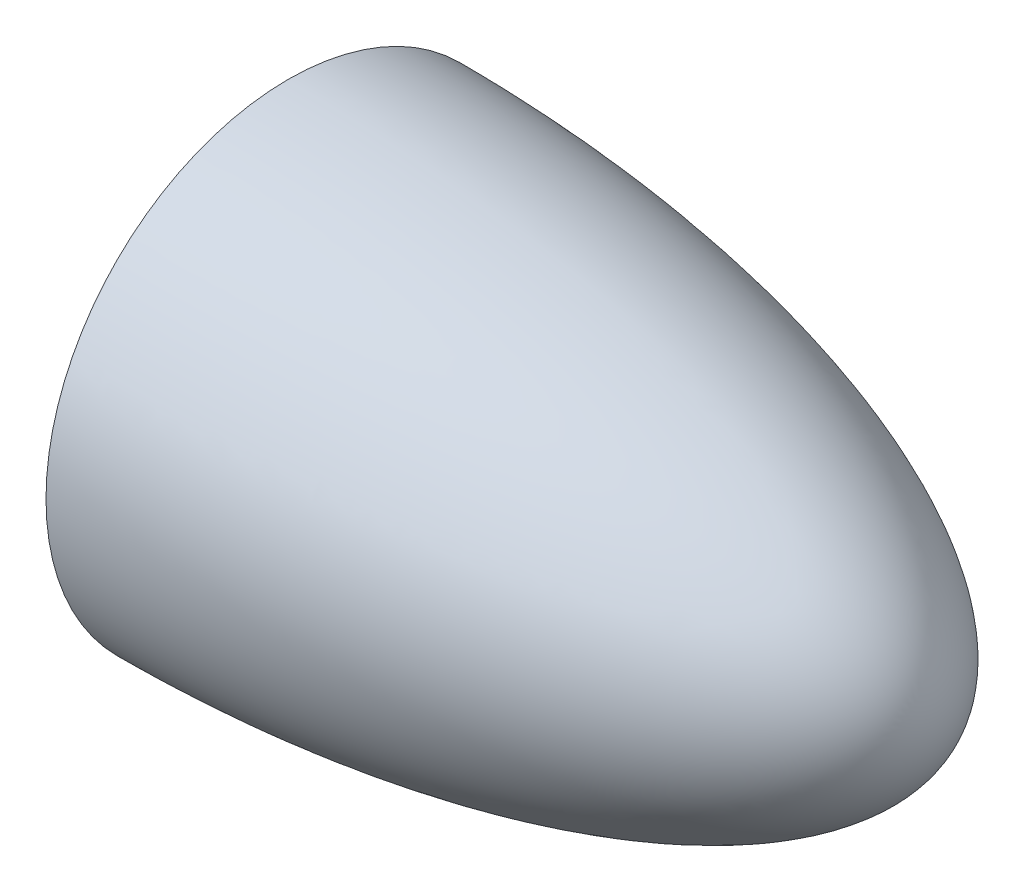
ISO-10303-21;
HEADER;
FILE_DESCRIPTION(('STEP AP214'),'2;1');
FILE_NAME('part.step','',(''),(''),'','','');
FILE_SCHEMA(('AUTOMOTIVE_DESIGN { 1 0 10303 214 1 1 1 1 }'));
ENDSEC;
DATA;
#1=APPLICATION_CONTEXT('core data for automotive mechanical design processes');
#2=APPLICATION_PROTOCOL_DEFINITION('international standard','automotive_design',2000,#1);
#3=PRODUCT_CONTEXT('',#1,'mechanical');
#4=PRODUCT('Part','Part','',(#3));
#5=PRODUCT_RELATED_PRODUCT_CATEGORY('part','',(#4));
#6=PRODUCT_DEFINITION_FORMATION('','',#4);
#7=PRODUCT_DEFINITION_CONTEXT('part definition',#1,'design');
#8=PRODUCT_DEFINITION('design','',#6,#7);
#9=PRODUCT_DEFINITION_SHAPE('','',#8);
#10=(LENGTH_UNIT() NAMED_UNIT(*) SI_UNIT(.MILLI.,.METRE.));
#11=(NAMED_UNIT(*) PLANE_ANGLE_UNIT() SI_UNIT($,.RADIAN.));
#12=(NAMED_UNIT(*) SI_UNIT($,.STERADIAN.) SOLID_ANGLE_UNIT());
#13=UNCERTAINTY_MEASURE_WITH_UNIT(LENGTH_MEASURE(1.E-05),#10,'distance_accuracy_value','');
#14=(GEOMETRIC_REPRESENTATION_CONTEXT(3) GLOBAL_UNCERTAINTY_ASSIGNED_CONTEXT((#13)) GLOBAL_UNIT_ASSIGNED_CONTEXT((#10,
#11,#12)) REPRESENTATION_CONTEXT('',''));
#15=CARTESIAN_POINT('',(0.,0.,0.));
#16=DIRECTION('',(0.,0.,1.));
#17=DIRECTION('',(1.,0.,0.));
#18=AXIS2_PLACEMENT_3D('',#15,#16,#17);
#19=CARTESIAN_POINT('',(101.600000000442,-1.42830048805565E-08,0.));
#20=CARTESIAN_POINT('',(101.599980360441,0.48323363335792,0.));
#21=CARTESIAN_POINT('',(101.55916409825,1.3889629163217,0.));
#22=CARTESIAN_POINT('',(101.380823498964,2.75715727471822,0.));
#23=CARTESIAN_POINT('',(100.938171709959,4.4725890120283,0.));
#24=CARTESIAN_POINT('',(100.331861268112,6.08897016765241,0.));
#25=CARTESIAN_POINT('',(99.5419733555983,7.69768669382983,0.));
#26=CARTESIAN_POINT('',(98.5662325669244,9.30621441511542,0.));
#27=CARTESIAN_POINT('',(97.298665836656,11.0336457708486,0.));
#28=CARTESIAN_POINT('',(95.7114523027373,12.8458752971799,0.));
#29=CARTESIAN_POINT('',(93.6297465486219,14.8636332281495,0.));
#30=CARTESIAN_POINT('',(91.0618684761844,16.9696414971854,0.));
#31=CARTESIAN_POINT('',(88.0736143415887,19.060703593436,0.));
#32=CARTESIAN_POINT('',(84.0819471067569,21.4677009974105,0.));
#33=CARTESIAN_POINT('',(79.9301974467493,23.5889965164497,0.));
#34=CARTESIAN_POINT('',(75.6687540651103,25.4756929979767,0.));
#35=CARTESIAN_POINT('',(70.4117097396729,27.5164690402247,0.));
#36=CARTESIAN_POINT('',(64.8413994370588,29.4022069077791,0.));
#37=CARTESIAN_POINT('',(59.1888689396233,31.026335536375,0.));
#38=CARTESIAN_POINT('',(53.478286526438,32.4263767824586,0.));
#39=CARTESIAN_POINT('',(48.6886027235161,33.4569390606596,0.));
#40=CARTESIAN_POINT('',(44.8412539235105,34.2042547409607,0.));
#41=CARTESIAN_POINT('',(40.98011959807,34.8782552337996,0.));
#42=CARTESIAN_POINT('',(37.1079386918977,35.4822148701438,0.));
#43=CARTESIAN_POINT('',(33.2250156494168,36.0189001691222,0.));
#44=CARTESIAN_POINT('',(29.3351731505379,36.4906677440588,0.));
#45=CARTESIAN_POINT('',(25.9229304373123,36.8483950158868,0.));
#46=CARTESIAN_POINT('',(22.998301967729,37.1167215937499,0.));
#47=CARTESIAN_POINT('',(20.5528829742709,37.3152225797583,0.));
#48=CARTESIAN_POINT('',(18.6058546115348,37.4591155736619,0.));
#49=CARTESIAN_POINT('',(16.1476970212435,37.6205191442379,0.));
#50=CARTESIAN_POINT('',(13.2403157224608,37.7849089049178,0.));
#51=CARTESIAN_POINT('',(10.2567025746124,37.9130835339428,0.));
#52=CARTESIAN_POINT('',(7.38531748689561,38.0054381493554,0.));
#53=CARTESIAN_POINT('',(4.83956379284109,38.0586501026854,0.));
#54=CARTESIAN_POINT('',(3.06234519295003,38.0870083587775,0.));
#55=CARTESIAN_POINT('',(1.33227298553929,38.0976378885102,0.));
#56=CARTESIAN_POINT('',(0.450260092714062,38.1000000009106,0.));
#57=CARTESIAN_POINT('',(6.16471890896308E-09,38.1000000009782,0.));
#58=B_SPLINE_CURVE_WITH_KNOTS('',4,(#19,#20,#21,#22,#23,#24,#25,#26,#27,#28,#29,#30,#31,#32,#33,
#34,#35,#36,#37,#38,#39,#40,#41,#42,#43,#44,#45,#46,#47,#48,#49,#50,#51,#52,#53,#54,#55,#56,
#57),.UNSPECIFIED.,.F.,.F.,(5,1,1,1,1,1,1,1,1,1,1,1,1,1,1,1,1,1,1,1,1,1,1,1,1,1,1,1,1,1,1,1,1,1,
1,5),(0.0808932835881966,0.096271967143896,0.10974671690448,0.124699008251176,0.137183447609697,
0.151141113359815,0.166736945280467,0.184522373855007,0.205319929879586,0.227752647732649,
0.258948982853048,0.290145341761614,0.321341650099034,0.376072862975788,0.407269225627566,
0.438465588279344,0.500858289877739,0.563250991378801,0.594447349480276,0.625643707581752,
0.656840067447748,0.688036427313743,0.7192327842067,0.750429141099656,0.781625497022952,
0.812821852946247,0.828420032283755,0.844018211621263,0.859616390958771,0.875214570296279,
0.906410927542586,0.937607284788894,0.953205463576025,0.968803642363157,0.984401821150288,1.),.UNSPECIFIED.);
#59=CARTESIAN_POINT('',(95.2499999953482,-1.20471063680405E-08,0.));
#60=DIRECTION('',(-1.,0.,0.));
#61=AXIS1_PLACEMENT('',#59,#60);
#62=SURFACE_OF_REVOLUTION('',#58,#61);
#63=CARTESIAN_POINT('',(-6.36116159746791E-10,-1.20470788979655E-08,0.));
#64=DIRECTION('',(-1.,0.,0.));
#65=DIRECTION('',(0.,-1.,0.));
#66=AXIS2_PLACEMENT_3D('',#63,#64,#65);
#67=CIRCLE('',#66,38.1000000130253);
#68=CARTESIAN_POINT('',(-6.36127147776795E-10,-38.1000000250723,0.));
#69=VERTEX_POINT('',#68);
#70=EDGE_CURVE('E11',#69,#69,#67,.T.);
#71=ORIENTED_EDGE('',*,*,#70,.F.);
#72=EDGE_LOOP('',(#71));
#73=FACE_BOUND('',#72,.T.);
#74=CARTESIAN_POINT('',(101.599999994479,-1.20471081993789E-08,0.));
#75=VERTEX_POINT('',#74);
#76=VERTEX_LOOP('',#75);
#77=FACE_BOUND('',#76,.T.);
#78=ADVANCED_FACE('F36',(#73,#77),#62,.T.);
#79=CARTESIAN_POINT('',(-6.36095702362055E-10,38.1000000009782,0.));
#80=DIRECTION('',(1.,0.,0.));
#81=DIRECTION('',(0.,1.,0.));
#82=AXIS2_PLACEMENT_3D('',#79,#80,#81);
#83=PLANE('',#82);
#84=CARTESIAN_POINT('',(-6.36116159746791E-10,-1.20470788979655E-08,0.));
#85=DIRECTION('',(-1.,0.,0.));
#86=DIRECTION('',(0.,-1.,0.));
#87=AXIS2_PLACEMENT_3D('',#84,#85,#86);
#88=CIRCLE('',#87,31.7500000120471);
#89=CARTESIAN_POINT('',(-6.36125316438461E-10,-31.7500000240942,0.));
#90=VERTEX_POINT('',#89);
#91=EDGE_CURVE('E44',#90,#90,#88,.T.);
#92=ORIENTED_EDGE('',*,*,#91,.F.);
#93=EDGE_LOOP('',(#92));
#94=FACE_BOUND('',#93,.T.);
#95=ORIENTED_EDGE('',*,*,#70,.T.);
#96=EDGE_LOOP('',(#95));
#97=FACE_BOUND('',#96,.T.);
#98=ADVANCED_FACE('F53',(#94,#97),#83,.F.);
#99=CARTESIAN_POINT('',(6.36089949159271E-10,31.75,0.));
#100=CARTESIAN_POINT('',(0.415190954921155,31.7499999999458,0.));
#101=CARTESIAN_POINT('',(1.25667944898068,31.7480893776024,0.));
#102=CARTESIAN_POINT('',(2.55470617475244,31.7409245248943,0.));
#103=CARTESIAN_POINT('',(3.82577090481741,31.7251552811414,0.));
#104=CARTESIAN_POINT('',(4.98114367236431,31.7072266245123,0.));
#105=CARTESIAN_POINT('',(5.88173367798066,31.690007828728,0.));
#106=CARTESIAN_POINT('',(7.01249869495455,31.6648844908458,0.));
#107=CARTESIAN_POINT('',(8.36979908105453,31.6289674017354,0.));
#108=CARTESIAN_POINT('',(9.95248249358343,31.5786274748133,0.));
#109=CARTESIAN_POINT('',(11.7611833752848,31.5094720031489,0.));
#110=CARTESIAN_POINT('',(13.5692431288622,31.4286272360575,0.));
#111=CARTESIAN_POINT('',(15.3768224486905,31.3360164154893,0.));
#112=CARTESIAN_POINT('',(17.1837089717345,31.2315508008061,0.));
#113=CARTESIAN_POINT('',(18.9898902620703,31.1151293079349,0.));
#114=CARTESIAN_POINT('',(21.2465784378282,30.9545151040567,0.));
#115=CARTESIAN_POINT('',(24.8548666437032,30.665006375013,0.));
#116=CARTESIAN_POINT('',(28.908660977464,30.2741574158616,0.));
#117=CARTESIAN_POINT('',(33.4037961058457,29.7537370537825,0.));
#118=CARTESIAN_POINT('',(37.8872506254305,29.1423093915246,0.));
#119=CARTESIAN_POINT('',(42.3604361976858,28.4597374809994,0.));
#120=CARTESIAN_POINT('',(47.7090835698653,27.5213669963097,0.));
#121=CARTESIAN_POINT('',(53.0276684985028,26.4218805432123,0.));
#122=CARTESIAN_POINT('',(58.3047892953142,25.1389397875777,0.));
#123=CARTESIAN_POINT('',(63.5381424099257,23.6898703292585,0.));
#124=CARTESIAN_POINT('',(68.7187349647178,22.0587837827557,0.));
#125=CARTESIAN_POINT('',(73.831931679806,20.1564354267299,0.));
#126=CARTESIAN_POINT('',(78.8057513132074,17.9126875737015,0.));
#127=CARTESIAN_POINT('',(82.8075036112578,15.7488442659369,0.));
#128=CARTESIAN_POINT('',(85.6345820670154,13.9649437855244,0.));
#129=CARTESIAN_POINT('',(88.043797839528,12.1762013895194,0.));
#130=CARTESIAN_POINT('',(89.9542956105547,10.491272960056,0.));
#131=CARTESIAN_POINT('',(91.3784340744685,9.01291548270743,0.));
#132=CARTESIAN_POINT('',(92.5157762385392,7.60352090681147,0.));
#133=CARTESIAN_POINT('',(93.3717596183504,6.32705180334712,0.));
#134=CARTESIAN_POINT('',(94.0371011880419,5.10816856865166,0.));
#135=CARTESIAN_POINT('',(94.5318947193299,3.95832396845887,0.));
#136=CARTESIAN_POINT('',(94.8869002848177,2.85782748092758,0.));
#137=CARTESIAN_POINT('',(95.1330868694309,1.729400952341,0.));
#138=CARTESIAN_POINT('',(95.2276251577043,0.883817947485008,0.));
#139=CARTESIAN_POINT('',(95.2499749097867,0.309070901426168,0.));
#140=CARTESIAN_POINT('',(95.2499999964932,-1.24287707202827E-08,0.));
#141=B_SPLINE_CURVE_WITH_KNOTS('',4,(#99,#100,#101,#102,#103,#104,#105,#106,#107,#108,#109,#110,
#111,#112,#113,#114,#115,#116,#117,#118,#119,#120,#121,#122,#123,#124,#125,#126,#127,#128,#129,
#130,#131,#132,#133,#134,#135,#136,#137,#138,#139,#140),.UNSPECIFIED.,.F.,.F.,(5,1,1,1,1,1,1,1,
1,1,1,1,1,1,1,1,1,1,1,1,1,1,1,1,1,1,1,1,1,1,1,1,1,1,1,1,1,1,5),(0.0824039784880026,
0.0980591799885079,0.113714381475022,0.121541982218279,0.129369582961537,0.137197183704794,
0.145024784448051,0.160679986047565,0.176335187647078,0.191990389246592,0.207645590846106,
0.223300792569362,0.238955994292619,0.254611196015875,0.270266397739132,0.30157680041548,
0.364197606625075,0.395508010158323,0.426818410664011,0.458128811169699,0.520749616832555,
0.583370420369003,0.614680824677453,0.645991228985903,0.708612011117745,0.771232791507689,
0.803294464607556,0.834604941813512,0.865915313023625,0.886788421497362,0.906994606661242,
0.92264823493514,0.936849642544257,0.949371689620419,0.960097505629187,0.97062702918645,
0.980098404155818,0.98931612616468,1.),.UNSPECIFIED.);
#142=CARTESIAN_POINT('',(95.2499999953482,-1.20471063680405E-08,0.));
#143=DIRECTION('',(-1.,0.,0.));
#144=AXIS1_PLACEMENT('',#142,#143);
#145=SURFACE_OF_REVOLUTION('',#141,#144);
#146=CARTESIAN_POINT('',(95.2499999964932,-1.24287707202827E-08,0.));
#147=VERTEX_POINT('',#146);
#148=VERTEX_LOOP('',#147);
#149=FACE_BOUND('',#148,.T.);
#150=ORIENTED_EDGE('',*,*,#91,.T.);
#151=EDGE_LOOP('',(#150));
#152=FACE_BOUND('',#151,.T.);
#153=ADVANCED_FACE('F50',(#149,#152),#145,.T.);
#154=CLOSED_SHELL('',(#78,#98,#153));
#155=MANIFOLD_SOLID_BREP('B2',#154);
#156=ADVANCED_BREP_SHAPE_REPRESENTATION('',(#18,#155),#14);
#157=SHAPE_DEFINITION_REPRESENTATION(#9,#156);
ENDSEC;
END-ISO-10303-21;
